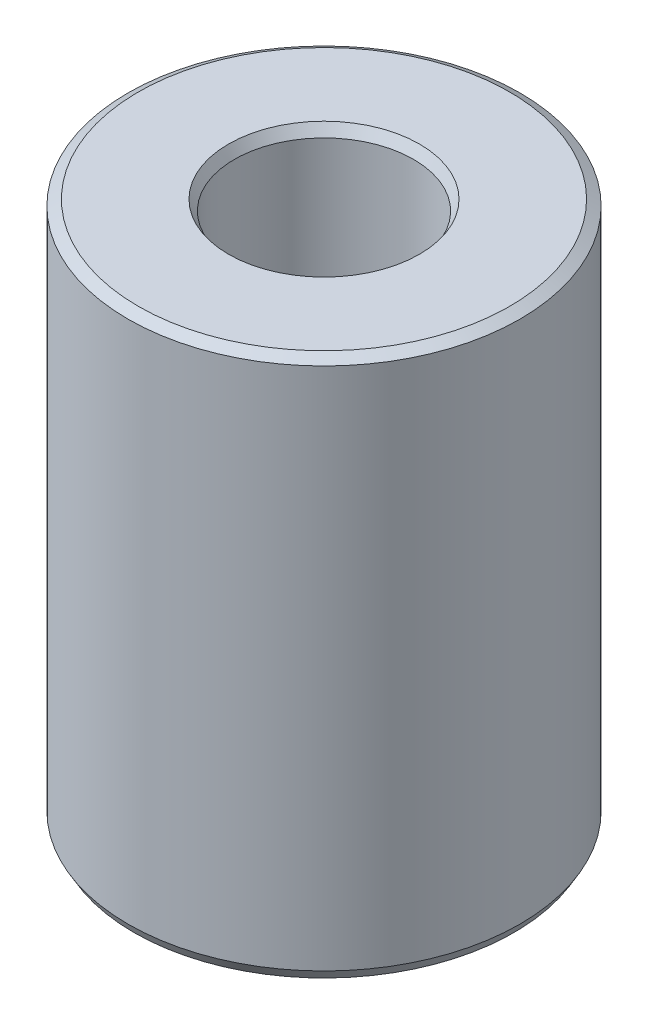
ISO-10303-21;
HEADER;
FILE_DESCRIPTION(('STEP AP214'),'2;1');
FILE_NAME('part.step','',(''),(''),'','','');
FILE_SCHEMA(('AUTOMOTIVE_DESIGN { 1 0 10303 214 1 1 1 1 }'));
ENDSEC;
DATA;
#1=APPLICATION_CONTEXT('core data for automotive mechanical design processes');
#2=APPLICATION_PROTOCOL_DEFINITION('international standard','automotive_design',2000,#1);
#3=PRODUCT_CONTEXT('',#1,'mechanical');
#4=PRODUCT('Part','Part','',(#3));
#5=PRODUCT_RELATED_PRODUCT_CATEGORY('part','',(#4));
#6=PRODUCT_DEFINITION_FORMATION('','',#4);
#7=PRODUCT_DEFINITION_CONTEXT('part definition',#1,'design');
#8=PRODUCT_DEFINITION('design','',#6,#7);
#9=PRODUCT_DEFINITION_SHAPE('','',#8);
#10=(LENGTH_UNIT() NAMED_UNIT(*) SI_UNIT(.MILLI.,.METRE.));
#11=(NAMED_UNIT(*) PLANE_ANGLE_UNIT() SI_UNIT($,.RADIAN.));
#12=(NAMED_UNIT(*) SI_UNIT($,.STERADIAN.) SOLID_ANGLE_UNIT());
#13=UNCERTAINTY_MEASURE_WITH_UNIT(LENGTH_MEASURE(1.E-05),#10,'distance_accuracy_value','');
#14=(GEOMETRIC_REPRESENTATION_CONTEXT(3) GLOBAL_UNCERTAINTY_ASSIGNED_CONTEXT((#13)) GLOBAL_UNIT_ASSIGNED_CONTEXT((#10,
#11,#12)) REPRESENTATION_CONTEXT('',''));
#15=CARTESIAN_POINT('',(0.,0.,0.));
#16=DIRECTION('',(0.,0.,1.));
#17=DIRECTION('',(1.,0.,0.));
#18=AXIS2_PLACEMENT_3D('',#15,#16,#17);
#19=CARTESIAN_POINT('',(0.,82.6931931453716,0.));
#20=DIRECTION('',(0.,-1.,0.));
#21=DIRECTION('',(0.,0.,-1.));
#22=AXIS2_PLACEMENT_3D('',#19,#20,#21);
#23=CYLINDRICAL_SURFACE('',#22,30.);
#24=CARTESIAN_POINT('',(0.,1.57372186772704,0.));
#25=DIRECTION('',(0.,1.,0.));
#26=DIRECTION('',(0.,0.,1.));
#27=AXIS2_PLACEMENT_3D('',#24,#25,#26);
#28=CIRCLE('',#27,30.);
#29=CARTESIAN_POINT('',(0.,1.57372186772704,30.));
#30=VERTEX_POINT('',#29);
#31=EDGE_CURVE('E10',#30,#30,#28,.T.);
#32=ORIENTED_EDGE('',*,*,#31,.T.);
#33=EDGE_LOOP('',(#32));
#34=FACE_BOUND('',#33,.T.);
#35=CARTESIAN_POINT('',(0.,81.7846044014097,0.));
#36=DIRECTION('',(0.,1.,0.));
#37=DIRECTION('',(0.,0.,1.));
#38=AXIS2_PLACEMENT_3D('',#35,#36,#37);
#39=CIRCLE('',#38,30.);
#40=CARTESIAN_POINT('',(0.,81.7846044014097,30.));
#41=VERTEX_POINT('',#40);
#42=EDGE_CURVE('E50',#41,#41,#39,.F.);
#43=ORIENTED_EDGE('',*,*,#42,.T.);
#44=EDGE_LOOP('',(#43));
#45=FACE_BOUND('',#44,.T.);
#46=ADVANCED_FACE('F39',(#34,#45),#23,.T.);
#47=CARTESIAN_POINT('',(0.,82.6931931453716,0.));
#48=DIRECTION('',(0.,1.,0.));
#49=DIRECTION('',(0.,0.,1.));
#50=AXIS2_PLACEMENT_3D('',#47,#48,#49);
#51=PLANE('',#50);
#52=CARTESIAN_POINT('',(0.,82.6931931453716,0.));
#53=DIRECTION('',(0.,1.,0.));
#54=DIRECTION('',(0.,0.,1.));
#55=AXIS2_PLACEMENT_3D('',#52,#53,#54);
#56=CIRCLE('',#55,14.6189331011936);
#57=CARTESIAN_POINT('',(0.,82.6931931453716,14.6189331011936));
#58=VERTEX_POINT('',#57);
#59=EDGE_CURVE('E58',#58,#58,#56,.F.);
#60=ORIENTED_EDGE('',*,*,#59,.T.);
#61=EDGE_LOOP('',(#60));
#62=FACE_BOUND('',#61,.T.);
#63=CARTESIAN_POINT('',(0.,82.6931931453716,0.));
#64=DIRECTION('',(0.,1.,0.));
#65=DIRECTION('',(0.,0.,1.));
#66=AXIS2_PLACEMENT_3D('',#63,#64,#65);
#67=CIRCLE('',#66,28.4262781322729);
#68=CARTESIAN_POINT('',(0.,82.6931931453716,28.4262781322729));
#69=VERTEX_POINT('',#68);
#70=EDGE_CURVE('E61',#69,#69,#67,.T.);
#71=ORIENTED_EDGE('',*,*,#70,.T.);
#72=EDGE_LOOP('',(#71));
#73=FACE_BOUND('',#72,.T.);
#74=ADVANCED_FACE('F88',(#62,#73),#51,.T.);
#75=CARTESIAN_POINT('',(0.,0.,0.));
#76=DIRECTION('',(0.,1.,0.));
#77=DIRECTION('',(0.,0.,1.));
#78=AXIS2_PLACEMENT_3D('',#75,#76,#77);
#79=PLANE('',#78);
#80=CARTESIAN_POINT('',(0.,0.,0.));
#81=DIRECTION('',(0.,1.,0.));
#82=DIRECTION('',(0.,0.,1.));
#83=AXIS2_PLACEMENT_3D('',#80,#81,#82);
#84=CIRCLE('',#83,15.2840662249589);
#85=CARTESIAN_POINT('',(0.,0.,15.2840662249589));
#86=VERTEX_POINT('',#85);
#87=EDGE_CURVE('E51',#86,#86,#84,.T.);
#88=ORIENTED_EDGE('',*,*,#87,.T.);
#89=EDGE_LOOP('',(#88));
#90=FACE_BOUND('',#89,.T.);
#91=CARTESIAN_POINT('',(0.,0.,0.));
#92=DIRECTION('',(0.,1.,0.));
#93=DIRECTION('',(0.,0.,1.));
#94=AXIS2_PLACEMENT_3D('',#91,#92,#93);
#95=CIRCLE('',#94,29.0914112560382);
#96=CARTESIAN_POINT('',(0.,0.,29.0914112560382));
#97=VERTEX_POINT('',#96);
#98=EDGE_CURVE('E54',#97,#97,#95,.F.);
#99=ORIENTED_EDGE('',*,*,#98,.T.);
#100=EDGE_LOOP('',(#99));
#101=FACE_BOUND('',#100,.T.);
#102=ADVANCED_FACE('F83',(#90,#101),#79,.F.);
#103=CARTESIAN_POINT('',(0.,82.6931931453716,0.));
#104=DIRECTION('',(0.,-1.,0.));
#105=DIRECTION('',(0.,0.,-1.));
#106=AXIS2_PLACEMENT_3D('',#103,#104,#105);
#107=CYLINDRICAL_SURFACE('',#106,13.7103443572318);
#108=CARTESIAN_POINT('',(0.,81.1194712776445,0.));
#109=DIRECTION('',(0.,1.,0.));
#110=DIRECTION('',(0.,0.,1.));
#111=AXIS2_PLACEMENT_3D('',#108,#109,#110);
#112=CIRCLE('',#111,13.7103443572318);
#113=CARTESIAN_POINT('',(0.,81.1194712776445,13.7103443572318));
#114=VERTEX_POINT('',#113);
#115=EDGE_CURVE('E67',#114,#114,#112,.T.);
#116=ORIENTED_EDGE('',*,*,#115,.T.);
#117=EDGE_LOOP('',(#116));
#118=FACE_BOUND('',#117,.T.);
#119=CARTESIAN_POINT('',(0.,0.908588743961838,0.));
#120=DIRECTION('',(0.,1.,0.));
#121=DIRECTION('',(0.,0.,1.));
#122=AXIS2_PLACEMENT_3D('',#119,#120,#121);
#123=CIRCLE('',#122,13.7103443572318);
#124=CARTESIAN_POINT('',(0.,0.908588743961838,13.7103443572318));
#125=VERTEX_POINT('',#124);
#126=EDGE_CURVE('E69',#125,#125,#123,.F.);
#127=ORIENTED_EDGE('',*,*,#126,.T.);
#128=EDGE_LOOP('',(#127));
#129=FACE_BOUND('',#128,.T.);
#130=ADVANCED_FACE('F71',(#118,#129),#107,.F.);
#131=CARTESIAN_POINT('',(0.,81.1194712776445,0.));
#132=DIRECTION('',(0.,1.,0.));
#133=DIRECTION('',(0.,0.,1.));
#134=AXIS2_PLACEMENT_3D('',#131,#132,#133);
#135=CONICAL_SURFACE('',#134,13.7103443572318,0.523598775598295);
#136=CARTESIAN_POINT('',(0.,82.6931931453716,14.6189331011936));
#137=CARTESIAN_POINT('',(0.,82.6768002092494,14.6094686351107));
#138=CARTESIAN_POINT('',(0.,82.6604072731273,14.6000041690278));
#139=CARTESIAN_POINT('',(0.,82.6276214008829,14.5810752368619));
#140=CARTESIAN_POINT('',(0.,82.6112284647608,14.5716107707789));
#141=CARTESIAN_POINT('',(0.,82.5784425925165,14.5526818386131));
#142=CARTESIAN_POINT('',(0.,82.5620496563943,14.5432173725301));
#143=CARTESIAN_POINT('',(0.,82.52926378415,14.5242884403643));
#144=CARTESIAN_POINT('',(0.,82.5128708480279,14.5148239742813));
#145=CARTESIAN_POINT('',(0.,82.4800849757835,14.4958950421155));
#146=CARTESIAN_POINT('',(0.,82.4636920396614,14.4864305760325));
#147=CARTESIAN_POINT('',(0.,82.4309061674171,14.4675016438667));
#148=CARTESIAN_POINT('',(0.,82.4145132312949,14.4580371777837));
#149=CARTESIAN_POINT('',(0.,82.3817273590506,14.4391082456179));
#150=CARTESIAN_POINT('',(0.,82.3653344229284,14.4296437795349));
#151=CARTESIAN_POINT('',(0.,82.3325485506841,14.410714847369));
#152=CARTESIAN_POINT('',(0.,82.316155614562,14.4012503812861));
#153=CARTESIAN_POINT('',(0.,82.2833697423177,14.3823214491202));
#154=CARTESIAN_POINT('',(0.,82.2669768061955,14.3728569830373));
#155=CARTESIAN_POINT('',(0.,82.2341909339512,14.3539280508714));
#156=CARTESIAN_POINT('',(0.,82.217797997829,14.3444635847885));
#157=CARTESIAN_POINT('',(0.,82.1850121255847,14.3255346526226));
#158=CARTESIAN_POINT('',(0.,82.1686191894626,14.3160701865397));
#159=CARTESIAN_POINT('',(0.,82.1358333172182,14.2971412543738));
#160=CARTESIAN_POINT('',(0.,82.1194403810961,14.2876767882909));
#161=CARTESIAN_POINT('',(0.,82.0866545088518,14.268747856125));
#162=CARTESIAN_POINT('',(0.,82.0702615727296,14.2592833900421));
#163=CARTESIAN_POINT('',(0.,82.0374757004853,14.2403544578762));
#164=CARTESIAN_POINT('',(0.,82.0210827643631,14.2308899917933));
#165=CARTESIAN_POINT('',(0.,81.9882968921188,14.2119610596274));
#166=CARTESIAN_POINT('',(0.,81.9719039559967,14.2024965935445));
#167=CARTESIAN_POINT('',(0.,81.9391180837524,14.1835676613786));
#168=CARTESIAN_POINT('',(0.,81.9227251476302,14.1741031952957));
#169=CARTESIAN_POINT('',(0.,81.8899392753859,14.1551742631298));
#170=CARTESIAN_POINT('',(0.,81.8735463392637,14.1457097970468));
#171=CARTESIAN_POINT('',(0.,81.8407604670194,14.126780864881));
#172=CARTESIAN_POINT('',(0.,81.8243675308973,14.117316398798));
#173=CARTESIAN_POINT('',(0.,81.791581658653,14.0983874666322));
#174=CARTESIAN_POINT('',(0.,81.7751887225308,14.0889230005492));
#175=CARTESIAN_POINT('',(0.,81.7424028502865,14.0699940683834));
#176=CARTESIAN_POINT('',(0.,81.7260099141643,14.0605296023004));
#177=CARTESIAN_POINT('',(0.,81.69322404192,14.0416006701346));
#178=CARTESIAN_POINT('',(0.,81.6768311057978,14.0321362040516));
#179=CARTESIAN_POINT('',(0.,81.6440452335535,14.0132072718857));
#180=CARTESIAN_POINT('',(0.,81.6276522974314,14.0037428058028));
#181=CARTESIAN_POINT('',(0.,81.5948664251871,13.9848138736369));
#182=CARTESIAN_POINT('',(0.,81.5784734890649,13.975349407554));
#183=CARTESIAN_POINT('',(0.,81.5456876168206,13.9564204753881));
#184=CARTESIAN_POINT('',(0.,81.5292946806984,13.9469560093052));
#185=CARTESIAN_POINT('',(0.,81.4965088084541,13.9280270771393));
#186=CARTESIAN_POINT('',(0.,81.480115872332,13.9185626110564));
#187=CARTESIAN_POINT('',(0.,81.4473300000876,13.8996336788905));
#188=CARTESIAN_POINT('',(0.,81.4309370639655,13.8901692128076));
#189=CARTESIAN_POINT('',(0.,81.3981511917212,13.8712402806417));
#190=CARTESIAN_POINT('',(0.,81.381758255599,13.8617758145588));
#191=CARTESIAN_POINT('',(0.,81.3489723833547,13.8428468823929));
#192=CARTESIAN_POINT('',(0.,81.3325794472325,13.83338241631));
#193=CARTESIAN_POINT('',(0.,81.2997935749882,13.8144534841441));
#194=CARTESIAN_POINT('',(0.,81.2834006388661,13.8049890180612));
#195=CARTESIAN_POINT('',(0.,81.2506147666218,13.7860600858953));
#196=CARTESIAN_POINT('',(0.,81.2342218304996,13.7765956198124));
#197=CARTESIAN_POINT('',(0.,81.2014359582553,13.7576666876465));
#198=CARTESIAN_POINT('',(0.,81.1850430221331,13.7482022215636));
#199=CARTESIAN_POINT('',(0.,81.1522571498888,13.7292732893977));
#200=CARTESIAN_POINT('',(0.,81.1358642137667,13.7198088233147));
#201=CARTESIAN_POINT('',(0.,81.1194712776445,13.7103443572318));
#202=B_SPLINE_CURVE_WITH_KNOTS('',3,(#136,#137,#138,#139,#140,#141,#142,#143,#144,#145,#146,
#147,#148,#149,#150,#151,#152,#153,#154,#155,#156,#157,#158,#159,#160,#161,#162,#163,#164,#165,
#166,#167,#168,#169,#170,#171,#172,#173,#174,#175,#176,#177,#178,#179,#180,#181,#182,#183,#184,
#185,#186,#187,#188,#189,#190,#191,#192,#193,#194,#195,#196,#197,#198,#199,#200,#201),
.UNSPECIFIED.,.F.,.F.,(4,2,2,2,2,2,2,2,2,2,2,2,2,2,2,2,2,2,2,2,2,2,2,2,2,2,2,2,2,2,2,2,4),(0.,
0.0567867964976234,0.113573592995235,0.170360389492846,0.227147185990458,0.283933982488081,
0.340720778985692,0.397507575483303,0.454294371980915,0.511081168478526,0.567867964976149,
0.624654761473761,0.681441557971372,0.738228354468984,0.795015150966606,0.851801947464218,
0.908588743961829,0.965375540459441,1.02216233695705,1.07894913345468,1.13573592995229,
1.1925227264499,1.24930952294751,1.30609631944513,1.36288311594274,1.41966991244035,
1.47645670893797,1.53324350543558,1.5900303019332,1.64681709843081,1.70360389492842,
1.76039069142603,1.81717748792365),.UNSPECIFIED.);
#203=EDGE_CURVE('BSEAM77',#58,#114,#202,.T.);
#204=ORIENTED_EDGE('',*,*,#59,.F.);
#205=ORIENTED_EDGE('',*,*,#115,.F.);
#206=ORIENTED_EDGE('',*,*,#203,.T.);
#207=ORIENTED_EDGE('',*,*,#203,.F.);
#208=EDGE_LOOP('',(#204,#206,#205,#207));
#209=FACE_BOUND('',#208,.T.);
#210=ADVANCED_FACE('F77',(#209),#135,.F.);
#211=CARTESIAN_POINT('',(0.,0.,0.));
#212=DIRECTION('',(0.,-1.,0.));
#213=DIRECTION('',(0.,0.,-1.));
#214=AXIS2_PLACEMENT_3D('',#211,#212,#213);
#215=CONICAL_SURFACE('',#214,15.2840662249589,1.04719755119659);
#216=ORIENTED_EDGE('',*,*,#126,.F.);
#217=EDGE_LOOP('',(#216));
#218=FACE_BOUND('',#217,.T.);
#219=ORIENTED_EDGE('',*,*,#87,.F.);
#220=EDGE_LOOP('',(#219));
#221=FACE_BOUND('',#220,.T.);
#222=ADVANCED_FACE('F73',(#218,#221),#215,.F.);
#223=CARTESIAN_POINT('',(0.,1.57372186772704,0.));
#224=DIRECTION('',(0.,1.,0.));
#225=DIRECTION('',(0.,0.,1.));
#226=AXIS2_PLACEMENT_3D('',#223,#224,#225);
#227=CONICAL_SURFACE('',#226,30.,0.5235987755983);
#228=ORIENTED_EDGE('',*,*,#98,.F.);
#229=EDGE_LOOP('',(#228));
#230=FACE_BOUND('',#229,.T.);
#231=ORIENTED_EDGE('',*,*,#31,.F.);
#232=EDGE_LOOP('',(#231));
#233=FACE_BOUND('',#232,.T.);
#234=ADVANCED_FACE('F76',(#230,#233),#227,.T.);
#235=CARTESIAN_POINT('',(0.,82.6931931453716,0.));
#236=DIRECTION('',(0.,-1.,0.));
#237=DIRECTION('',(0.,0.,-1.));
#238=AXIS2_PLACEMENT_3D('',#235,#236,#237);
#239=CONICAL_SURFACE('',#238,28.4262781322729,1.04719755119659);
#240=ORIENTED_EDGE('',*,*,#42,.F.);
#241=EDGE_LOOP('',(#240));
#242=FACE_BOUND('',#241,.T.);
#243=ORIENTED_EDGE('',*,*,#70,.F.);
#244=EDGE_LOOP('',(#243));
#245=FACE_BOUND('',#244,.T.);
#246=ADVANCED_FACE('F45',(#242,#245),#239,.T.);
#247=CLOSED_SHELL('',(#46,#74,#102,#130,#210,#222,#234,#246));
#248=MANIFOLD_SOLID_BREP('B2',#247);
#249=ADVANCED_BREP_SHAPE_REPRESENTATION('',(#18,#248),#14);
#250=SHAPE_DEFINITION_REPRESENTATION(#9,#249);
ENDSEC;
END-ISO-10303-21;
